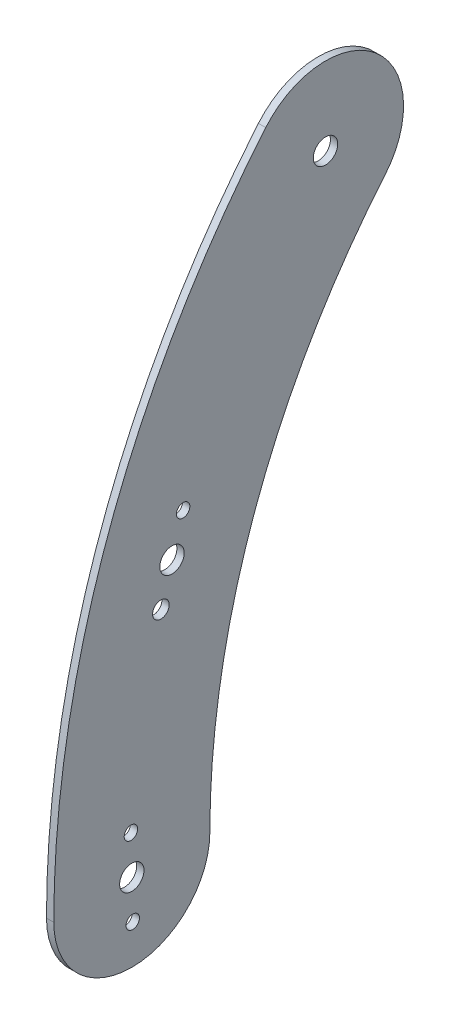
ISO-10303-21;
HEADER;
FILE_DESCRIPTION(('STEP AP214'),'2;1');
FILE_NAME('part.step','',(''),(''),'','','');
FILE_SCHEMA(('AUTOMOTIVE_DESIGN { 1 0 10303 214 1 1 1 1 }'));
ENDSEC;
DATA;
#1=APPLICATION_CONTEXT('core data for automotive mechanical design processes');
#2=APPLICATION_PROTOCOL_DEFINITION('international standard','automotive_design',2000,#1);
#3=PRODUCT_CONTEXT('',#1,'mechanical');
#4=PRODUCT('Part','Part','',(#3));
#5=PRODUCT_RELATED_PRODUCT_CATEGORY('part','',(#4));
#6=PRODUCT_DEFINITION_FORMATION('','',#4);
#7=PRODUCT_DEFINITION_CONTEXT('part definition',#1,'design');
#8=PRODUCT_DEFINITION('design','',#6,#7);
#9=PRODUCT_DEFINITION_SHAPE('','',#8);
#10=(LENGTH_UNIT() NAMED_UNIT(*) SI_UNIT(.MILLI.,.METRE.));
#11=(NAMED_UNIT(*) PLANE_ANGLE_UNIT() SI_UNIT($,.RADIAN.));
#12=(NAMED_UNIT(*) SI_UNIT($,.STERADIAN.) SOLID_ANGLE_UNIT());
#13=UNCERTAINTY_MEASURE_WITH_UNIT(LENGTH_MEASURE(1.E-05),#10,'distance_accuracy_value','');
#14=(GEOMETRIC_REPRESENTATION_CONTEXT(3) GLOBAL_UNCERTAINTY_ASSIGNED_CONTEXT((#13)) GLOBAL_UNIT_ASSIGNED_CONTEXT((#10,
#11,#12)) REPRESENTATION_CONTEXT('',''));
#15=CARTESIAN_POINT('',(0.,0.,0.));
#16=DIRECTION('',(0.,0.,1.));
#17=DIRECTION('',(1.,0.,0.));
#18=AXIS2_PLACEMENT_3D('',#15,#16,#17);
#19=CARTESIAN_POINT('',(-29.423102186696,93085.7893347694,177084.163049041));
#20=DIRECTION('',(1.,0.,0.));
#21=DIRECTION('',(0.,0.,-1.));
#22=AXIS2_PLACEMENT_3D('',#19,#20,#21);
#23=PLANE('',#22);
#24=CARTESIAN_POINT('',(-29.423102186696,93304.015728258,177344.23513748));
#25=DIRECTION('',(1.,0.,0.));
#26=DIRECTION('',(0.,0.,-1.));
#27=AXIS2_PLACEMENT_3D('',#24,#25,#26);
#28=CIRCLE('',#27,5.00000000007266);
#29=CARTESIAN_POINT('',(-29.423102186696,93304.015728258,177339.23513748));
#30=VERTEX_POINT('',#29);
#31=EDGE_CURVE('E92',#30,#30,#28,.T.);
#32=ORIENTED_EDGE('',*,*,#31,.T.);
#33=EDGE_LOOP('',(#32));
#34=FACE_BOUND('',#33,.T.);
#35=CARTESIAN_POINT('',(-29.423102186696,93205.6087527582,177402.62114216));
#36=DIRECTION('',(1.,0.,0.));
#37=DIRECTION('',(0.,0.,-1.));
#38=AXIS2_PLACEMENT_3D('',#35,#36,#37);
#39=CIRCLE('',#38,2.75000000004241);
#40=CARTESIAN_POINT('',(-29.423102186696,93205.6087527582,177399.87114216));
#41=VERTEX_POINT('',#40);
#42=EDGE_CURVE('E175',#41,#41,#39,.T.);
#43=ORIENTED_EDGE('',*,*,#42,.T.);
#44=EDGE_LOOP('',(#43));
#45=FACE_BOUND('',#44,.T.);
#46=CARTESIAN_POINT('',(-29.423102186696,93190.2735175447,177407.185193096));
#47=DIRECTION('',(1.,0.,0.));
#48=DIRECTION('',(0.,0.,-1.));
#49=AXIS2_PLACEMENT_3D('',#46,#47,#48);
#50=CIRCLE('',#49,4.99999999998281);
#51=CARTESIAN_POINT('',(-29.423102186696,93190.2735175447,177402.185193096));
#52=VERTEX_POINT('',#51);
#53=EDGE_CURVE('E173',#52,#52,#50,.T.);
#54=ORIENTED_EDGE('',*,*,#53,.T.);
#55=EDGE_LOOP('',(#54));
#56=FACE_BOUND('',#55,.T.);
#57=CARTESIAN_POINT('',(-29.423102186696,93174.9382823312,177411.749244032));
#58=DIRECTION('',(1.,0.,0.));
#59=DIRECTION('',(0.,0.,-1.));
#60=AXIS2_PLACEMENT_3D('',#57,#58,#59);
#61=CIRCLE('',#60,3.39999999999935);
#62=CARTESIAN_POINT('',(-29.423102186696,93174.9382823312,177408.349244032));
#63=VERTEX_POINT('',#62);
#64=EDGE_CURVE('E170',#63,#63,#61,.T.);
#65=ORIENTED_EDGE('',*,*,#64,.T.);
#66=EDGE_LOOP('',(#65));
#67=FACE_BOUND('',#66,.T.);
#68=CARTESIAN_POINT('',(-29.423102186696,93101.7848920314,177424.040074078));
#69=DIRECTION('',(1.,0.,0.));
#70=DIRECTION('',(0.,0.,-1.));
#71=AXIS2_PLACEMENT_3D('',#68,#69,#70);
#72=CIRCLE('',#71,2.74999999998806);
#73=CARTESIAN_POINT('',(-29.423102186696,93101.7848920314,177421.290074078));
#74=VERTEX_POINT('',#73);
#75=EDGE_CURVE('E167',#74,#74,#72,.T.);
#76=ORIENTED_EDGE('',*,*,#75,.T.);
#77=EDGE_LOOP('',(#76));
#78=FACE_BOUND('',#77,.T.);
#79=CARTESIAN_POINT('',(-29.423102186696,93085.7893347694,177423.663049041));
#80=DIRECTION('',(1.,0.,0.));
#81=DIRECTION('',(0.,0.,-1.));
#82=AXIS2_PLACEMENT_3D('',#79,#80,#81);
#83=CIRCLE('',#82,4.99999999997866);
#84=CARTESIAN_POINT('',(-29.423102186696,93085.7893347694,177418.663049041));
#85=VERTEX_POINT('',#84);
#86=EDGE_CURVE('E164',#85,#85,#83,.T.);
#87=ORIENTED_EDGE('',*,*,#86,.T.);
#88=EDGE_LOOP('',(#87));
#89=FACE_BOUND('',#88,.T.);
#90=CARTESIAN_POINT('',(-29.423102186696,93069.7937775074,177423.286024004));
#91=DIRECTION('',(1.,0.,0.));
#92=DIRECTION('',(0.,0.,-1.));
#93=AXIS2_PLACEMENT_3D('',#90,#91,#92);
#94=CIRCLE('',#93,2.74999999998806);
#95=CARTESIAN_POINT('',(-29.423102186696,93069.7937775074,177420.536024004));
#96=VERTEX_POINT('',#95);
#97=EDGE_CURVE('E155',#96,#96,#94,.T.);
#98=ORIENTED_EDGE('',*,*,#97,.T.);
#99=EDGE_LOOP('',(#98));
#100=FACE_BOUND('',#99,.T.);
#101=CARTESIAN_POINT('',(-29.423102186696,93304.015728258,177344.23513748));
#102=DIRECTION('',(1.,0.,0.));
#103=DIRECTION('',(0.,0.,-1.));
#104=AXIS2_PLACEMENT_3D('',#101,#102,#103);
#105=CIRCLE('',#104,31.9999999999959);
#106=CARTESIAN_POINT('',(-29.423102186696,93283.446524748,177319.7217153));
#107=VERTEX_POINT('',#106);
#108=CARTESIAN_POINT('',(-29.423102186696,93324.5849317679,177368.74855966));
#109=VERTEX_POINT('',#108);
#110=EDGE_CURVE('E97',#107,#109,#105,.T.);
#111=ORIENTED_EDGE('',*,*,#110,.F.);
#112=CARTESIAN_POINT('',(-29.423102186696,93085.7893347694,177084.163049041));
#113=DIRECTION('',(1.,0.,0.));
#114=DIRECTION('',(0.,0.,-1.));
#115=AXIS2_PLACEMENT_3D('',#112,#113,#114);
#116=CIRCLE('',#115,307.500000000005);
#117=CARTESIAN_POINT('',(-29.423102186696,93085.7893347694,177391.663049041));
#118=VERTEX_POINT('',#117);
#119=EDGE_CURVE('E12',#107,#118,#116,.T.);
#120=ORIENTED_EDGE('',*,*,#119,.T.);
#121=CARTESIAN_POINT('',(-29.423102186696,93085.7893347694,177423.663049041));
#122=DIRECTION('',(1.,0.,0.));
#123=DIRECTION('',(0.,0.,-1.));
#124=AXIS2_PLACEMENT_3D('',#121,#122,#123);
#125=CIRCLE('',#124,31.9999999999823);
#126=CARTESIAN_POINT('',(-29.423102186696,93085.7893347694,177455.663049041));
#127=VERTEX_POINT('',#126);
#128=EDGE_CURVE('E158',#127,#118,#125,.T.);
#129=ORIENTED_EDGE('',*,*,#128,.F.);
#130=CARTESIAN_POINT('',(-29.423102186696,93085.7893347694,177084.163049041));
#131=DIRECTION('',(1.,0.,0.));
#132=DIRECTION('',(0.,0.,-1.));
#133=AXIS2_PLACEMENT_3D('',#130,#131,#132);
#134=CIRCLE('',#133,371.500000000008);
#135=EDGE_CURVE('E137',#109,#127,#134,.T.);
#136=ORIENTED_EDGE('',*,*,#135,.F.);
#137=EDGE_LOOP('',(#111,#120,#129,#136));
#138=FACE_BOUND('',#137,.T.);
#139=ADVANCED_FACE('F88',(#34,#45,#56,#67,#78,#89,#100,#138),#23,.F.);
#140=CARTESIAN_POINT('',(-36.423102186696,93085.7893347694,177084.163049041));
#141=DIRECTION('',(1.,0.,0.));
#142=DIRECTION('',(0.,0.,-1.));
#143=AXIS2_PLACEMENT_3D('',#140,#141,#142);
#144=CYLINDRICAL_SURFACE('',#143,307.500000000005);
#145=DIRECTION('',(1.,0.,0.));
#146=VECTOR('',#145,1.);
#147=CARTESIAN_POINT('',(-36.423102186696,93283.446524748,177319.7217153));
#148=LINE('',#147,#146);
#149=CARTESIAN_POINT('',(-26.423102186696,93283.446524748,177319.7217153));
#150=VERTEX_POINT('',#149);
#151=EDGE_CURVE('E153',#107,#150,#148,.T.);
#152=ORIENTED_EDGE('',*,*,#151,.T.);
#153=CARTESIAN_POINT('',(-26.423102186696,93085.7893347694,177084.163049041));
#154=DIRECTION('',(1.,0.,0.));
#155=DIRECTION('',(0.,0.,-1.));
#156=AXIS2_PLACEMENT_3D('',#153,#154,#155);
#157=CIRCLE('',#156,307.500000000005);
#158=CARTESIAN_POINT('',(-26.423102186696,93085.7893347694,177391.663049041));
#159=VERTEX_POINT('',#158);
#160=EDGE_CURVE('E105',#150,#159,#157,.T.);
#161=ORIENTED_EDGE('',*,*,#160,.T.);
#162=DIRECTION('',(1.,0.,0.));
#163=VECTOR('',#162,1.);
#164=CARTESIAN_POINT('',(-36.423102186696,93085.7893347694,177391.663049041));
#165=LINE('',#164,#163);
#166=EDGE_CURVE('E140',#118,#159,#165,.T.);
#167=ORIENTED_EDGE('',*,*,#166,.F.);
#168=ORIENTED_EDGE('',*,*,#119,.F.);
#169=EDGE_LOOP('',(#152,#161,#167,#168));
#170=FACE_BOUND('',#169,.T.);
#171=ADVANCED_FACE('F200',(#170),#144,.F.);
#172=CARTESIAN_POINT('',(-36.423102186696,93304.015728258,177344.23513748));
#173=DIRECTION('',(1.,0.,0.));
#174=DIRECTION('',(0.,0.,-1.));
#175=AXIS2_PLACEMENT_3D('',#172,#173,#174);
#176=CYLINDRICAL_SURFACE('',#175,31.9999999999959);
#177=ORIENTED_EDGE('',*,*,#110,.T.);
#178=DIRECTION('',(1.,0.,0.));
#179=VECTOR('',#178,1.);
#180=CARTESIAN_POINT('',(-36.423102186696,93324.5849317679,177368.74855966));
#181=LINE('',#180,#179);
#182=CARTESIAN_POINT('',(-26.423102186696,93324.5849317679,177368.74855966));
#183=VERTEX_POINT('',#182);
#184=EDGE_CURVE('E139',#109,#183,#181,.T.);
#185=ORIENTED_EDGE('',*,*,#184,.T.);
#186=CARTESIAN_POINT('',(-26.423102186696,93304.015728258,177344.23513748));
#187=DIRECTION('',(1.,0.,0.));
#188=DIRECTION('',(0.,0.,-1.));
#189=AXIS2_PLACEMENT_3D('',#186,#187,#188);
#190=CIRCLE('',#189,31.9999999999959);
#191=EDGE_CURVE('E148',#150,#183,#190,.T.);
#192=ORIENTED_EDGE('',*,*,#191,.F.);
#193=ORIENTED_EDGE('',*,*,#151,.F.);
#194=EDGE_LOOP('',(#177,#185,#192,#193));
#195=FACE_BOUND('',#194,.T.);
#196=ADVANCED_FACE('F204',(#195),#176,.T.);
#197=CARTESIAN_POINT('',(-36.423102186696,93085.7893347694,177084.163049041));
#198=DIRECTION('',(1.,0.,0.));
#199=DIRECTION('',(0.,0.,-1.));
#200=AXIS2_PLACEMENT_3D('',#197,#198,#199);
#201=CYLINDRICAL_SURFACE('',#200,371.500000000008);
#202=ORIENTED_EDGE('',*,*,#135,.T.);
#203=DIRECTION('',(1.,0.,0.));
#204=VECTOR('',#203,1.);
#205=CARTESIAN_POINT('',(-36.423102186696,93085.7893347694,177455.663049041));
#206=LINE('',#205,#204);
#207=CARTESIAN_POINT('',(-26.423102186696,93085.7893347694,177455.663049041));
#208=VERTEX_POINT('',#207);
#209=EDGE_CURVE('E113',#127,#208,#206,.T.);
#210=ORIENTED_EDGE('',*,*,#209,.T.);
#211=CARTESIAN_POINT('',(-26.423102186696,93085.7893347694,177084.163049041));
#212=DIRECTION('',(1.,0.,0.));
#213=DIRECTION('',(0.,0.,-1.));
#214=AXIS2_PLACEMENT_3D('',#211,#212,#213);
#215=CIRCLE('',#214,371.500000000008);
#216=EDGE_CURVE('E134',#183,#208,#215,.T.);
#217=ORIENTED_EDGE('',*,*,#216,.F.);
#218=ORIENTED_EDGE('',*,*,#184,.F.);
#219=EDGE_LOOP('',(#202,#210,#217,#218));
#220=FACE_BOUND('',#219,.T.);
#221=ADVANCED_FACE('F131',(#220),#201,.T.);
#222=CARTESIAN_POINT('',(-36.423102186696,93085.7893347694,177423.663049041));
#223=DIRECTION('',(1.,0.,0.));
#224=DIRECTION('',(0.,0.,-1.));
#225=AXIS2_PLACEMENT_3D('',#222,#223,#224);
#226=CYLINDRICAL_SURFACE('',#225,31.9999999999823);
#227=ORIENTED_EDGE('',*,*,#128,.T.);
#228=ORIENTED_EDGE('',*,*,#166,.T.);
#229=CARTESIAN_POINT('',(-26.423102186696,93085.7893347694,177423.663049041));
#230=DIRECTION('',(1.,0.,0.));
#231=DIRECTION('',(0.,0.,-1.));
#232=AXIS2_PLACEMENT_3D('',#229,#230,#231);
#233=CIRCLE('',#232,31.9999999999823);
#234=EDGE_CURVE('E143',#208,#159,#233,.T.);
#235=ORIENTED_EDGE('',*,*,#234,.F.);
#236=ORIENTED_EDGE('',*,*,#209,.F.);
#237=EDGE_LOOP('',(#227,#228,#235,#236));
#238=FACE_BOUND('',#237,.T.);
#239=ADVANCED_FACE('F144',(#238),#226,.T.);
#240=CARTESIAN_POINT('',(-36.423102186696,93069.7937775074,177423.286024004));
#241=DIRECTION('',(1.,0.,0.));
#242=DIRECTION('',(0.,0.,-1.));
#243=AXIS2_PLACEMENT_3D('',#240,#241,#242);
#244=CYLINDRICAL_SURFACE('',#243,2.74999999998806);
#245=CARTESIAN_POINT('',(-26.423102186696,93069.7937775074,177423.286024004));
#246=DIRECTION('',(1.,0.,0.));
#247=DIRECTION('',(0.,0.,-1.));
#248=AXIS2_PLACEMENT_3D('',#245,#246,#247);
#249=CIRCLE('',#248,2.74999999998806);
#250=CARTESIAN_POINT('',(-26.423102186696,93069.7937775074,177420.536024004));
#251=VERTEX_POINT('',#250);
#252=EDGE_CURVE('E218',#251,#251,#249,.T.);
#253=ORIENTED_EDGE('',*,*,#252,.T.);
#254=EDGE_LOOP('',(#253));
#255=FACE_BOUND('',#254,.T.);
#256=ORIENTED_EDGE('',*,*,#97,.F.);
#257=EDGE_LOOP('',(#256));
#258=FACE_BOUND('',#257,.T.);
#259=ADVANCED_FACE('F209',(#255,#258),#244,.F.);
#260=CARTESIAN_POINT('',(-36.423102186696,93085.7893347694,177423.663049041));
#261=DIRECTION('',(1.,0.,0.));
#262=DIRECTION('',(0.,0.,-1.));
#263=AXIS2_PLACEMENT_3D('',#260,#261,#262);
#264=CYLINDRICAL_SURFACE('',#263,4.99999999997866);
#265=CARTESIAN_POINT('',(-26.423102186696,93085.7893347694,177423.663049041));
#266=DIRECTION('',(1.,0.,0.));
#267=DIRECTION('',(0.,0.,-1.));
#268=AXIS2_PLACEMENT_3D('',#265,#266,#267);
#269=CIRCLE('',#268,4.99999999997866);
#270=CARTESIAN_POINT('',(-26.423102186696,93085.7893347694,177418.663049041));
#271=VERTEX_POINT('',#270);
#272=EDGE_CURVE('E220',#271,#271,#269,.T.);
#273=ORIENTED_EDGE('',*,*,#272,.T.);
#274=EDGE_LOOP('',(#273));
#275=FACE_BOUND('',#274,.T.);
#276=ORIENTED_EDGE('',*,*,#86,.F.);
#277=EDGE_LOOP('',(#276));
#278=FACE_BOUND('',#277,.T.);
#279=ADVANCED_FACE('F240',(#275,#278),#264,.F.);
#280=CARTESIAN_POINT('',(-36.423102186696,93101.7848920314,177424.040074078));
#281=DIRECTION('',(1.,0.,0.));
#282=DIRECTION('',(0.,0.,-1.));
#283=AXIS2_PLACEMENT_3D('',#280,#281,#282);
#284=CYLINDRICAL_SURFACE('',#283,2.74999999998806);
#285=CARTESIAN_POINT('',(-26.423102186696,93101.7848920314,177424.040074078));
#286=DIRECTION('',(1.,0.,0.));
#287=DIRECTION('',(0.,0.,-1.));
#288=AXIS2_PLACEMENT_3D('',#285,#286,#287);
#289=CIRCLE('',#288,2.74999999998806);
#290=CARTESIAN_POINT('',(-26.423102186696,93101.7848920314,177421.290074078));
#291=VERTEX_POINT('',#290);
#292=EDGE_CURVE('E234',#291,#291,#289,.T.);
#293=ORIENTED_EDGE('',*,*,#292,.T.);
#294=EDGE_LOOP('',(#293));
#295=FACE_BOUND('',#294,.T.);
#296=ORIENTED_EDGE('',*,*,#75,.F.);
#297=EDGE_LOOP('',(#296));
#298=FACE_BOUND('',#297,.T.);
#299=ADVANCED_FACE('F254',(#295,#298),#284,.F.);
#300=CARTESIAN_POINT('',(-36.423102186696,93174.9382823312,177411.749244032));
#301=DIRECTION('',(1.,0.,0.));
#302=DIRECTION('',(0.,0.,-1.));
#303=AXIS2_PLACEMENT_3D('',#300,#301,#302);
#304=CYLINDRICAL_SURFACE('',#303,3.39999999999935);
#305=CARTESIAN_POINT('',(-26.423102186696,93174.9382823312,177411.749244032));
#306=DIRECTION('',(1.,0.,0.));
#307=DIRECTION('',(0.,0.,-1.));
#308=AXIS2_PLACEMENT_3D('',#305,#306,#307);
#309=CIRCLE('',#308,3.39999999999935);
#310=CARTESIAN_POINT('',(-26.423102186696,93174.9382823312,177408.349244032));
#311=VERTEX_POINT('',#310);
#312=EDGE_CURVE('E231',#311,#311,#309,.T.);
#313=ORIENTED_EDGE('',*,*,#312,.T.);
#314=EDGE_LOOP('',(#313));
#315=FACE_BOUND('',#314,.T.);
#316=ORIENTED_EDGE('',*,*,#64,.F.);
#317=EDGE_LOOP('',(#316));
#318=FACE_BOUND('',#317,.T.);
#319=ADVANCED_FACE('F259',(#315,#318),#304,.F.);
#320=CARTESIAN_POINT('',(-36.423102186696,93190.2735175447,177407.185193096));
#321=DIRECTION('',(1.,0.,0.));
#322=DIRECTION('',(0.,0.,-1.));
#323=AXIS2_PLACEMENT_3D('',#320,#321,#322);
#324=CYLINDRICAL_SURFACE('',#323,4.99999999998281);
#325=CARTESIAN_POINT('',(-26.423102186696,93190.2735175447,177407.185193096));
#326=DIRECTION('',(1.,0.,0.));
#327=DIRECTION('',(0.,0.,-1.));
#328=AXIS2_PLACEMENT_3D('',#325,#326,#327);
#329=CIRCLE('',#328,4.99999999998281);
#330=CARTESIAN_POINT('',(-26.423102186696,93190.2735175447,177402.185193096));
#331=VERTEX_POINT('',#330);
#332=EDGE_CURVE('E228',#331,#331,#329,.T.);
#333=ORIENTED_EDGE('',*,*,#332,.T.);
#334=EDGE_LOOP('',(#333));
#335=FACE_BOUND('',#334,.T.);
#336=ORIENTED_EDGE('',*,*,#53,.F.);
#337=EDGE_LOOP('',(#336));
#338=FACE_BOUND('',#337,.T.);
#339=ADVANCED_FACE('F194',(#335,#338),#324,.F.);
#340=CARTESIAN_POINT('',(-36.423102186696,93205.6087527582,177402.62114216));
#341=DIRECTION('',(1.,0.,0.));
#342=DIRECTION('',(0.,0.,-1.));
#343=AXIS2_PLACEMENT_3D('',#340,#341,#342);
#344=CYLINDRICAL_SURFACE('',#343,2.75000000004241);
#345=CARTESIAN_POINT('',(-26.423102186696,93205.6087527582,177402.62114216));
#346=DIRECTION('',(1.,0.,0.));
#347=DIRECTION('',(0.,0.,-1.));
#348=AXIS2_PLACEMENT_3D('',#345,#346,#347);
#349=CIRCLE('',#348,2.75000000004241);
#350=CARTESIAN_POINT('',(-26.423102186696,93205.6087527582,177399.87114216));
#351=VERTEX_POINT('',#350);
#352=EDGE_CURVE('E225',#351,#351,#349,.T.);
#353=ORIENTED_EDGE('',*,*,#352,.T.);
#354=EDGE_LOOP('',(#353));
#355=FACE_BOUND('',#354,.T.);
#356=ORIENTED_EDGE('',*,*,#42,.F.);
#357=EDGE_LOOP('',(#356));
#358=FACE_BOUND('',#357,.T.);
#359=ADVANCED_FACE('F185',(#355,#358),#344,.F.);
#360=CARTESIAN_POINT('',(-36.423102186696,93304.015728258,177344.23513748));
#361=DIRECTION('',(1.,0.,0.));
#362=DIRECTION('',(0.,0.,-1.));
#363=AXIS2_PLACEMENT_3D('',#360,#361,#362);
#364=CYLINDRICAL_SURFACE('',#363,5.00000000007266);
#365=CARTESIAN_POINT('',(-26.423102186696,93304.015728258,177344.23513748));
#366=DIRECTION('',(1.,0.,0.));
#367=DIRECTION('',(0.,0.,-1.));
#368=AXIS2_PLACEMENT_3D('',#365,#366,#367);
#369=CIRCLE('',#368,5.00000000007266);
#370=CARTESIAN_POINT('',(-26.423102186696,93304.015728258,177339.23513748));
#371=VERTEX_POINT('',#370);
#372=EDGE_CURVE('E223',#371,#371,#369,.T.);
#373=ORIENTED_EDGE('',*,*,#372,.T.);
#374=EDGE_LOOP('',(#373));
#375=FACE_BOUND('',#374,.T.);
#376=ORIENTED_EDGE('',*,*,#31,.F.);
#377=EDGE_LOOP('',(#376));
#378=FACE_BOUND('',#377,.T.);
#379=ADVANCED_FACE('F183',(#375,#378),#364,.F.);
#380=CARTESIAN_POINT('',(-26.423102186696,93085.7893347694,177084.163049041));
#381=DIRECTION('',(-1.,0.,0.));
#382=DIRECTION('',(0.,0.,1.));
#383=AXIS2_PLACEMENT_3D('',#380,#381,#382);
#384=PLANE('',#383);
#385=ORIENTED_EDGE('',*,*,#372,.F.);
#386=EDGE_LOOP('',(#385));
#387=FACE_BOUND('',#386,.T.);
#388=ORIENTED_EDGE('',*,*,#352,.F.);
#389=EDGE_LOOP('',(#388));
#390=FACE_BOUND('',#389,.T.);
#391=ORIENTED_EDGE('',*,*,#332,.F.);
#392=EDGE_LOOP('',(#391));
#393=FACE_BOUND('',#392,.T.);
#394=ORIENTED_EDGE('',*,*,#312,.F.);
#395=EDGE_LOOP('',(#394));
#396=FACE_BOUND('',#395,.T.);
#397=ORIENTED_EDGE('',*,*,#292,.F.);
#398=EDGE_LOOP('',(#397));
#399=FACE_BOUND('',#398,.T.);
#400=ORIENTED_EDGE('',*,*,#272,.F.);
#401=EDGE_LOOP('',(#400));
#402=FACE_BOUND('',#401,.T.);
#403=ORIENTED_EDGE('',*,*,#252,.F.);
#404=EDGE_LOOP('',(#403));
#405=FACE_BOUND('',#404,.T.);
#406=ORIENTED_EDGE('',*,*,#234,.T.);
#407=ORIENTED_EDGE('',*,*,#160,.F.);
#408=ORIENTED_EDGE('',*,*,#191,.T.);
#409=ORIENTED_EDGE('',*,*,#216,.T.);
#410=EDGE_LOOP('',(#406,#407,#408,#409));
#411=FACE_BOUND('',#410,.T.);
#412=ADVANCED_FACE('F90',(#387,#390,#393,#396,#399,#402,#405,#411),#384,.F.);
#413=CLOSED_SHELL('',(#139,#171,#196,#221,#239,#259,#279,#299,#319,#339,#359,#379,#412));
#414=MANIFOLD_SOLID_BREP('B2',#413);
#415=ADVANCED_BREP_SHAPE_REPRESENTATION('',(#18,#414),#14);
#416=SHAPE_DEFINITION_REPRESENTATION(#9,#415);
ENDSEC;
END-ISO-10303-21;
